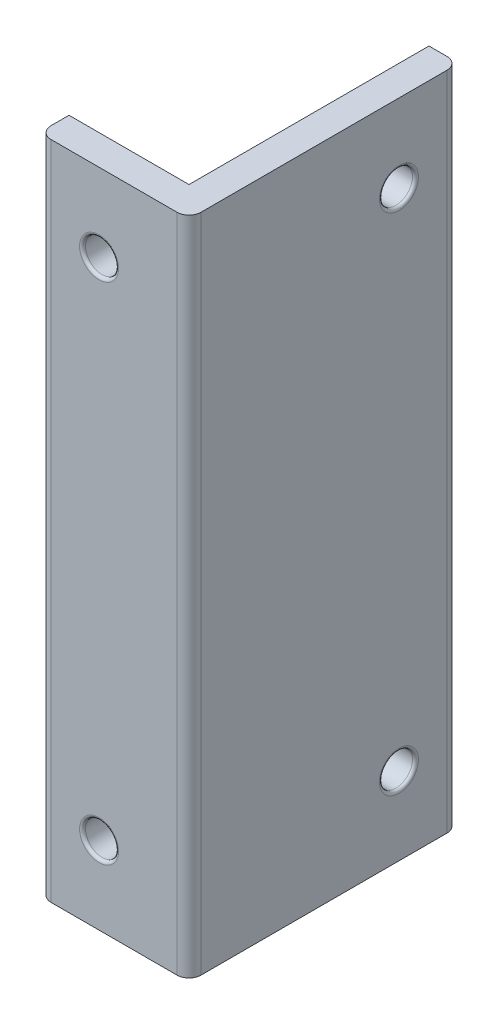
ISO-10303-21;
HEADER;
FILE_DESCRIPTION(('STEP AP214'),'2;1');
FILE_NAME('part.step','',(''),(''),'','','');
FILE_SCHEMA(('AUTOMOTIVE_DESIGN { 1 0 10303 214 1 1 1 1 }'));
ENDSEC;
DATA;
#1=APPLICATION_CONTEXT('core data for automotive mechanical design processes');
#2=APPLICATION_PROTOCOL_DEFINITION('international standard','automotive_design',2000,#1);
#3=PRODUCT_CONTEXT('',#1,'mechanical');
#4=PRODUCT('Part','Part','',(#3));
#5=PRODUCT_RELATED_PRODUCT_CATEGORY('part','',(#4));
#6=PRODUCT_DEFINITION_FORMATION('','',#4);
#7=PRODUCT_DEFINITION_CONTEXT('part definition',#1,'design');
#8=PRODUCT_DEFINITION('design','',#6,#7);
#9=PRODUCT_DEFINITION_SHAPE('','',#8);
#10=(LENGTH_UNIT() NAMED_UNIT(*) SI_UNIT(.MILLI.,.METRE.));
#11=(NAMED_UNIT(*) PLANE_ANGLE_UNIT() SI_UNIT($,.RADIAN.));
#12=(NAMED_UNIT(*) SI_UNIT($,.STERADIAN.) SOLID_ANGLE_UNIT());
#13=UNCERTAINTY_MEASURE_WITH_UNIT(LENGTH_MEASURE(1.E-05),#10,'distance_accuracy_value','');
#14=(GEOMETRIC_REPRESENTATION_CONTEXT(3) GLOBAL_UNCERTAINTY_ASSIGNED_CONTEXT((#13)) GLOBAL_UNIT_ASSIGNED_CONTEXT((#10,
#11,#12)) REPRESENTATION_CONTEXT('',''));
#15=CARTESIAN_POINT('',(0.,0.,0.));
#16=DIRECTION('',(0.,0.,1.));
#17=DIRECTION('',(1.,0.,0.));
#18=AXIS2_PLACEMENT_3D('',#15,#16,#17);
#19=CARTESIAN_POINT('',(12.5,110.14,-42.5));
#20=DIRECTION('',(0.,0.,1.));
#21=DIRECTION('',(1.,0.,0.));
#22=AXIS2_PLACEMENT_3D('',#19,#20,#21);
#23=PLANE('',#22);
#24=DIRECTION('',(-1.,0.,0.));
#25=VECTOR('',#24,1.);
#26=CARTESIAN_POINT('',(12.5,110.14,-42.5));
#27=LINE('',#26,#25);
#28=CARTESIAN_POINT('',(10.5,110.14,-42.5));
#29=VERTEX_POINT('',#28);
#30=CARTESIAN_POINT('',(7.5,110.14,-42.5));
#31=VERTEX_POINT('',#30);
#32=EDGE_CURVE('E112',#29,#31,#27,.T.);
#33=ORIENTED_EDGE('',*,*,#32,.F.);
#34=DIRECTION('',(0.,-1.,0.));
#35=VECTOR('',#34,1.);
#36=CARTESIAN_POINT('',(10.5,110.14,-42.5));
#37=LINE('',#36,#35);
#38=CARTESIAN_POINT('',(10.5,0.,-42.5));
#39=VERTEX_POINT('',#38);
#40=EDGE_CURVE('E51',#29,#39,#37,.T.);
#41=ORIENTED_EDGE('',*,*,#40,.T.);
#42=DIRECTION('',(-1.,0.,0.));
#43=VECTOR('',#42,1.);
#44=CARTESIAN_POINT('',(12.5,0.,-42.5));
#45=LINE('',#44,#43);
#46=CARTESIAN_POINT('',(7.5,0.,-42.5));
#47=VERTEX_POINT('',#46);
#48=EDGE_CURVE('E127',#39,#47,#45,.T.);
#49=ORIENTED_EDGE('',*,*,#48,.T.);
#50=DIRECTION('',(0.,-1.,0.));
#51=VECTOR('',#50,1.);
#52=CARTESIAN_POINT('',(7.5,110.14,-42.5));
#53=LINE('',#52,#51);
#54=EDGE_CURVE('E125',#31,#47,#53,.T.);
#55=ORIENTED_EDGE('',*,*,#54,.F.);
#56=EDGE_LOOP('',(#33,#41,#49,#55));
#57=FACE_BOUND('',#56,.T.);
#58=ADVANCED_FACE('F43',(#57),#23,.F.);
#59=CARTESIAN_POINT('',(7.5,110.14,-2.50000000000003));
#60=DIRECTION('',(1.,0.,0.));
#61=DIRECTION('',(0.,0.,-1.));
#62=AXIS2_PLACEMENT_3D('',#59,#60,#61);
#63=PLANE('',#62);
#64=CARTESIAN_POINT('',(7.5,97.14,-32.5));
#65=DIRECTION('',(1.,0.,0.));
#66=DIRECTION('',(0.,0.,-1.));
#67=AXIS2_PLACEMENT_3D('',#64,#65,#66);
#68=CIRCLE('',#67,3.25);
#69=CARTESIAN_POINT('',(7.5,97.14,-35.75));
#70=VERTEX_POINT('',#69);
#71=EDGE_CURVE('E164',#70,#70,#68,.T.);
#72=ORIENTED_EDGE('',*,*,#71,.T.);
#73=EDGE_LOOP('',(#72));
#74=FACE_BOUND('',#73,.T.);
#75=CARTESIAN_POINT('',(7.5,13.,-32.5));
#76=DIRECTION('',(1.,0.,0.));
#77=DIRECTION('',(0.,0.,-1.));
#78=AXIS2_PLACEMENT_3D('',#75,#76,#77);
#79=CIRCLE('',#78,3.25);
#80=CARTESIAN_POINT('',(7.5,13.,-35.75));
#81=VERTEX_POINT('',#80);
#82=EDGE_CURVE('E130',#81,#81,#79,.T.);
#83=ORIENTED_EDGE('',*,*,#82,.T.);
#84=EDGE_LOOP('',(#83));
#85=FACE_BOUND('',#84,.T.);
#86=DIRECTION('',(0.,0.,1.));
#87=VECTOR('',#86,1.);
#88=CARTESIAN_POINT('',(7.5,0.,-2.50000000000003));
#89=LINE('',#88,#87);
#90=CARTESIAN_POINT('',(7.5,0.,-2.50000000000003));
#91=VERTEX_POINT('',#90);
#92=EDGE_CURVE('E147',#47,#91,#89,.T.);
#93=ORIENTED_EDGE('',*,*,#92,.T.);
#94=DIRECTION('',(0.,-1.,0.));
#95=VECTOR('',#94,1.);
#96=CARTESIAN_POINT('',(7.5,110.14,-2.50000000000003));
#97=LINE('',#96,#95);
#98=CARTESIAN_POINT('',(7.5,110.14,-2.50000000000003));
#99=VERTEX_POINT('',#98);
#100=EDGE_CURVE('E131',#99,#91,#97,.T.);
#101=ORIENTED_EDGE('',*,*,#100,.F.);
#102=DIRECTION('',(0.,0.,1.));
#103=VECTOR('',#102,1.);
#104=CARTESIAN_POINT('',(7.5,110.14,-2.50000000000003));
#105=LINE('',#104,#103);
#106=EDGE_CURVE('E117',#31,#99,#105,.T.);
#107=ORIENTED_EDGE('',*,*,#106,.F.);
#108=ORIENTED_EDGE('',*,*,#54,.T.);
#109=EDGE_LOOP('',(#93,#101,#107,#108));
#110=FACE_BOUND('',#109,.T.);
#111=ADVANCED_FACE('F133',(#74,#85,#110),#63,.F.);
#112=CARTESIAN_POINT('',(-12.5,110.14,-2.5));
#113=DIRECTION('',(0.,0.,1.));
#114=DIRECTION('',(1.,0.,0.));
#115=AXIS2_PLACEMENT_3D('',#112,#113,#114);
#116=PLANE('',#115);
#117=CARTESIAN_POINT('',(-2.49999999999999,13.,-2.50000000000001));
#118=DIRECTION('',(0.,0.,1.));
#119=DIRECTION('',(1.,0.,0.));
#120=AXIS2_PLACEMENT_3D('',#117,#118,#119);
#121=CIRCLE('',#120,3.25);
#122=CARTESIAN_POINT('',(0.750000000000009,13.,-2.50000000000002));
#123=VERTEX_POINT('',#122);
#124=EDGE_CURVE('E188',#123,#123,#121,.T.);
#125=ORIENTED_EDGE('',*,*,#124,.T.);
#126=EDGE_LOOP('',(#125));
#127=FACE_BOUND('',#126,.T.);
#128=CARTESIAN_POINT('',(-2.5,97.14,-2.50000000000001));
#129=DIRECTION('',(0.,0.,1.));
#130=DIRECTION('',(1.,0.,0.));
#131=AXIS2_PLACEMENT_3D('',#128,#129,#130);
#132=CIRCLE('',#131,3.25);
#133=CARTESIAN_POINT('',(0.75,97.14,-2.50000000000002));
#134=VERTEX_POINT('',#133);
#135=EDGE_CURVE('E185',#134,#134,#132,.T.);
#136=ORIENTED_EDGE('',*,*,#135,.T.);
#137=EDGE_LOOP('',(#136));
#138=FACE_BOUND('',#137,.T.);
#139=DIRECTION('',(-1.,0.,0.));
#140=VECTOR('',#139,1.);
#141=CARTESIAN_POINT('',(-12.5,0.,-2.5));
#142=LINE('',#141,#140);
#143=CARTESIAN_POINT('',(-12.5,0.,-2.5));
#144=VERTEX_POINT('',#143);
#145=EDGE_CURVE('E149',#91,#144,#142,.T.);
#146=ORIENTED_EDGE('',*,*,#145,.T.);
#147=DIRECTION('',(0.,-1.,0.));
#148=VECTOR('',#147,1.);
#149=CARTESIAN_POINT('',(-12.5,110.14,-2.5));
#150=LINE('',#149,#148);
#151=CARTESIAN_POINT('',(-12.5,110.14,-2.5));
#152=VERTEX_POINT('',#151);
#153=EDGE_CURVE('E145',#152,#144,#150,.T.);
#154=ORIENTED_EDGE('',*,*,#153,.F.);
#155=DIRECTION('',(-1.,0.,0.));
#156=VECTOR('',#155,1.);
#157=CARTESIAN_POINT('',(-12.5,110.14,-2.5));
#158=LINE('',#157,#156);
#159=EDGE_CURVE('E136',#99,#152,#158,.T.);
#160=ORIENTED_EDGE('',*,*,#159,.F.);
#161=ORIENTED_EDGE('',*,*,#100,.T.);
#162=EDGE_LOOP('',(#146,#154,#160,#161));
#163=FACE_BOUND('',#162,.T.);
#164=ADVANCED_FACE('F236',(#127,#138,#163),#116,.F.);
#165=CARTESIAN_POINT('',(-12.5,110.14,2.5));
#166=DIRECTION('',(1.,0.,0.));
#167=DIRECTION('',(0.,0.,-1.));
#168=AXIS2_PLACEMENT_3D('',#165,#166,#167);
#169=PLANE('',#168);
#170=DIRECTION('',(0.,0.,1.));
#171=VECTOR('',#170,1.);
#172=CARTESIAN_POINT('',(-12.5,0.,2.5));
#173=LINE('',#172,#171);
#174=CARTESIAN_POINT('',(-12.5,0.,0.500000000000002));
#175=VERTEX_POINT('',#174);
#176=EDGE_CURVE('E151',#144,#175,#173,.T.);
#177=ORIENTED_EDGE('',*,*,#176,.T.);
#178=DIRECTION('',(0.,-1.,0.));
#179=VECTOR('',#178,1.);
#180=CARTESIAN_POINT('',(-12.5,110.14,0.500000000000002));
#181=LINE('',#180,#179);
#182=CARTESIAN_POINT('',(-12.5,110.14,0.500000000000002));
#183=VERTEX_POINT('',#182);
#184=EDGE_CURVE('E11',#175,#183,#181,.F.);
#185=ORIENTED_EDGE('',*,*,#184,.T.);
#186=DIRECTION('',(0.,0.,1.));
#187=VECTOR('',#186,1.);
#188=CARTESIAN_POINT('',(-12.5,110.14,2.5));
#189=LINE('',#188,#187);
#190=EDGE_CURVE('E138',#152,#183,#189,.T.);
#191=ORIENTED_EDGE('',*,*,#190,.F.);
#192=ORIENTED_EDGE('',*,*,#153,.T.);
#193=EDGE_LOOP('',(#177,#185,#191,#192));
#194=FACE_BOUND('',#193,.T.);
#195=ADVANCED_FACE('F332',(#194),#169,.F.);
#196=CARTESIAN_POINT('',(-12.5,110.14,2.5));
#197=DIRECTION('',(0.,0.,-1.));
#198=DIRECTION('',(-1.,0.,0.));
#199=AXIS2_PLACEMENT_3D('',#196,#197,#198);
#200=PLANE('',#199);
#201=CARTESIAN_POINT('',(-2.49999999999999,13.,2.5));
#202=DIRECTION('',(0.,0.,-1.));
#203=DIRECTION('',(-1.,0.,0.));
#204=AXIS2_PLACEMENT_3D('',#201,#202,#203);
#205=CIRCLE('',#204,3.25);
#206=CARTESIAN_POINT('',(-5.74999999999999,13.,2.5));
#207=VERTEX_POINT('',#206);
#208=EDGE_CURVE('E200',#207,#207,#205,.T.);
#209=ORIENTED_EDGE('',*,*,#208,.T.);
#210=EDGE_LOOP('',(#209));
#211=FACE_BOUND('',#210,.T.);
#212=CARTESIAN_POINT('',(-2.5,97.14,2.5));
#213=DIRECTION('',(0.,0.,-1.));
#214=DIRECTION('',(-1.,0.,0.));
#215=AXIS2_PLACEMENT_3D('',#212,#213,#214);
#216=CIRCLE('',#215,3.25);
#217=CARTESIAN_POINT('',(-5.75000000000001,97.14,2.5));
#218=VERTEX_POINT('',#217);
#219=EDGE_CURVE('E197',#218,#218,#216,.T.);
#220=ORIENTED_EDGE('',*,*,#219,.T.);
#221=EDGE_LOOP('',(#220));
#222=FACE_BOUND('',#221,.T.);
#223=DIRECTION('',(1.,0.,0.));
#224=VECTOR('',#223,1.);
#225=CARTESIAN_POINT('',(-12.5,0.,2.5));
#226=LINE('',#225,#224);
#227=CARTESIAN_POINT('',(-10.5,0.,2.5));
#228=VERTEX_POINT('',#227);
#229=CARTESIAN_POINT('',(10.5,0.,2.5));
#230=VERTEX_POINT('',#229);
#231=EDGE_CURVE('E153',#228,#230,#226,.T.);
#232=ORIENTED_EDGE('',*,*,#231,.T.);
#233=DIRECTION('',(0.,-1.,0.));
#234=VECTOR('',#233,1.);
#235=CARTESIAN_POINT('',(10.5,110.14,2.5));
#236=LINE('',#235,#234);
#237=CARTESIAN_POINT('',(10.5,110.14,2.5));
#238=VERTEX_POINT('',#237);
#239=EDGE_CURVE('E223',#230,#238,#236,.F.);
#240=ORIENTED_EDGE('',*,*,#239,.T.);
#241=DIRECTION('',(1.,0.,0.));
#242=VECTOR('',#241,1.);
#243=CARTESIAN_POINT('',(-12.5,110.14,2.5));
#244=LINE('',#243,#242);
#245=CARTESIAN_POINT('',(-10.5,110.14,2.5));
#246=VERTEX_POINT('',#245);
#247=EDGE_CURVE('E143',#246,#238,#244,.T.);
#248=ORIENTED_EDGE('',*,*,#247,.F.);
#249=DIRECTION('',(0.,-1.,0.));
#250=VECTOR('',#249,1.);
#251=CARTESIAN_POINT('',(-10.5,110.14,2.5));
#252=LINE('',#251,#250);
#253=EDGE_CURVE('E220',#246,#228,#252,.T.);
#254=ORIENTED_EDGE('',*,*,#253,.T.);
#255=EDGE_LOOP('',(#232,#240,#248,#254));
#256=FACE_BOUND('',#255,.T.);
#257=ADVANCED_FACE('F244',(#211,#222,#256),#200,.F.);
#258=CARTESIAN_POINT('',(12.5,110.14,2.5));
#259=DIRECTION('',(-1.,0.,0.));
#260=DIRECTION('',(0.,0.,1.));
#261=AXIS2_PLACEMENT_3D('',#258,#259,#260);
#262=PLANE('',#261);
#263=CARTESIAN_POINT('',(12.5,97.14,-32.5));
#264=DIRECTION('',(-1.,0.,0.));
#265=DIRECTION('',(0.,0.,1.));
#266=AXIS2_PLACEMENT_3D('',#263,#264,#265);
#267=CIRCLE('',#266,3.25);
#268=CARTESIAN_POINT('',(12.5,97.14,-29.25));
#269=VERTEX_POINT('',#268);
#270=EDGE_CURVE('E176',#269,#269,#267,.T.);
#271=ORIENTED_EDGE('',*,*,#270,.T.);
#272=EDGE_LOOP('',(#271));
#273=FACE_BOUND('',#272,.T.);
#274=CARTESIAN_POINT('',(12.5,13.,-32.5));
#275=DIRECTION('',(-1.,0.,0.));
#276=DIRECTION('',(0.,0.,1.));
#277=AXIS2_PLACEMENT_3D('',#274,#275,#276);
#278=CIRCLE('',#277,3.25);
#279=CARTESIAN_POINT('',(12.5,13.,-29.25));
#280=VERTEX_POINT('',#279);
#281=EDGE_CURVE('E173',#280,#280,#278,.T.);
#282=ORIENTED_EDGE('',*,*,#281,.T.);
#283=EDGE_LOOP('',(#282));
#284=FACE_BOUND('',#283,.T.);
#285=DIRECTION('',(0.,0.,-1.));
#286=VECTOR('',#285,1.);
#287=CARTESIAN_POINT('',(12.5,110.14,-2.50000000000003));
#288=LINE('',#287,#286);
#289=CARTESIAN_POINT('',(12.5,110.14,0.500000000000003));
#290=VERTEX_POINT('',#289);
#291=CARTESIAN_POINT('',(12.5,110.14,-40.5));
#292=VERTEX_POINT('',#291);
#293=EDGE_CURVE('E122',#290,#292,#288,.T.);
#294=ORIENTED_EDGE('',*,*,#293,.F.);
#295=DIRECTION('',(0.,-1.,0.));
#296=VECTOR('',#295,1.);
#297=CARTESIAN_POINT('',(12.5,110.14,0.500000000000003));
#298=LINE('',#297,#296);
#299=CARTESIAN_POINT('',(12.5,0.,0.500000000000003));
#300=VERTEX_POINT('',#299);
#301=EDGE_CURVE('E211',#290,#300,#298,.T.);
#302=ORIENTED_EDGE('',*,*,#301,.T.);
#303=DIRECTION('',(0.,0.,-1.));
#304=VECTOR('',#303,1.);
#305=CARTESIAN_POINT('',(12.5,0.,2.5));
#306=LINE('',#305,#304);
#307=CARTESIAN_POINT('',(12.5,0.,-40.5));
#308=VERTEX_POINT('',#307);
#309=EDGE_CURVE('E156',#300,#308,#306,.T.);
#310=ORIENTED_EDGE('',*,*,#309,.T.);
#311=DIRECTION('',(0.,-1.,0.));
#312=VECTOR('',#311,1.);
#313=CARTESIAN_POINT('',(12.5,110.14,-40.5));
#314=LINE('',#313,#312);
#315=EDGE_CURVE('E209',#308,#292,#314,.F.);
#316=ORIENTED_EDGE('',*,*,#315,.T.);
#317=EDGE_LOOP('',(#294,#302,#310,#316));
#318=FACE_BOUND('',#317,.T.);
#319=ADVANCED_FACE('F252',(#273,#284,#318),#262,.F.);
#320=CARTESIAN_POINT('',(0.,110.14,0.));
#321=DIRECTION('',(0.,1.,0.));
#322=DIRECTION('',(0.,0.,1.));
#323=AXIS2_PLACEMENT_3D('',#320,#321,#322);
#324=PLANE('',#323);
#325=ORIENTED_EDGE('',*,*,#247,.T.);
#326=CARTESIAN_POINT('',(10.5,110.14,0.500000000000003));
#327=DIRECTION('',(0.,1.,0.));
#328=DIRECTION('',(0.,0.,1.));
#329=AXIS2_PLACEMENT_3D('',#326,#327,#328);
#330=CIRCLE('',#329,2.);
#331=EDGE_CURVE('E228',#238,#290,#330,.T.);
#332=ORIENTED_EDGE('',*,*,#331,.T.);
#333=ORIENTED_EDGE('',*,*,#293,.T.);
#334=CARTESIAN_POINT('',(10.5,110.14,-40.5));
#335=DIRECTION('',(0.,1.,0.));
#336=DIRECTION('',(0.,0.,1.));
#337=AXIS2_PLACEMENT_3D('',#334,#335,#336);
#338=CIRCLE('',#337,2.);
#339=EDGE_CURVE('E64',#292,#29,#338,.T.);
#340=ORIENTED_EDGE('',*,*,#339,.T.);
#341=ORIENTED_EDGE('',*,*,#32,.T.);
#342=ORIENTED_EDGE('',*,*,#106,.T.);
#343=ORIENTED_EDGE('',*,*,#159,.T.);
#344=ORIENTED_EDGE('',*,*,#190,.T.);
#345=CARTESIAN_POINT('',(-10.5,110.14,0.500000000000002));
#346=DIRECTION('',(0.,1.,0.));
#347=DIRECTION('',(0.,0.,1.));
#348=AXIS2_PLACEMENT_3D('',#345,#346,#347);
#349=CIRCLE('',#348,2.);
#350=EDGE_CURVE('E225',#183,#246,#349,.T.);
#351=ORIENTED_EDGE('',*,*,#350,.T.);
#352=EDGE_LOOP('',(#325,#332,#333,#340,#341,#342,#343,#344,#351));
#353=FACE_BOUND('',#352,.T.);
#354=ADVANCED_FACE('F115',(#353),#324,.T.);
#355=CARTESIAN_POINT('',(0.,0.,0.));
#356=DIRECTION('',(0.,1.,0.));
#357=DIRECTION('',(0.,0.,1.));
#358=AXIS2_PLACEMENT_3D('',#355,#356,#357);
#359=PLANE('',#358);
#360=ORIENTED_EDGE('',*,*,#309,.F.);
#361=CARTESIAN_POINT('',(10.5,0.,0.500000000000003));
#362=DIRECTION('',(0.,1.,0.));
#363=DIRECTION('',(0.,0.,1.));
#364=AXIS2_PLACEMENT_3D('',#361,#362,#363);
#365=CIRCLE('',#364,2.);
#366=EDGE_CURVE('E218',#300,#230,#365,.F.);
#367=ORIENTED_EDGE('',*,*,#366,.T.);
#368=ORIENTED_EDGE('',*,*,#231,.F.);
#369=CARTESIAN_POINT('',(-10.5,0.,0.500000000000002));
#370=DIRECTION('',(0.,1.,0.));
#371=DIRECTION('',(0.,0.,1.));
#372=AXIS2_PLACEMENT_3D('',#369,#370,#371);
#373=CIRCLE('',#372,2.);
#374=EDGE_CURVE('E214',#228,#175,#373,.F.);
#375=ORIENTED_EDGE('',*,*,#374,.T.);
#376=ORIENTED_EDGE('',*,*,#176,.F.);
#377=ORIENTED_EDGE('',*,*,#145,.F.);
#378=ORIENTED_EDGE('',*,*,#92,.F.);
#379=ORIENTED_EDGE('',*,*,#48,.F.);
#380=CARTESIAN_POINT('',(10.5,0.,-40.5));
#381=DIRECTION('',(0.,1.,0.));
#382=DIRECTION('',(0.,0.,1.));
#383=AXIS2_PLACEMENT_3D('',#380,#381,#382);
#384=CIRCLE('',#383,2.);
#385=EDGE_CURVE('E216',#39,#308,#384,.F.);
#386=ORIENTED_EDGE('',*,*,#385,.T.);
#387=EDGE_LOOP('',(#360,#367,#368,#375,#376,#377,#378,#379,#386));
#388=FACE_BOUND('',#387,.T.);
#389=ADVANCED_FACE('F232',(#388),#359,.F.);
#390=CARTESIAN_POINT('',(-2.5,97.14,-42.5));
#391=DIRECTION('',(0.,0.,1.));
#392=DIRECTION('',(1.,0.,0.));
#393=AXIS2_PLACEMENT_3D('',#390,#391,#392);
#394=CYLINDRICAL_SURFACE('',#393,2.75);
#395=CARTESIAN_POINT('',(-2.5,97.14,-2.00000000000001));
#396=DIRECTION('',(0.,0.,1.));
#397=DIRECTION('',(1.,0.,0.));
#398=AXIS2_PLACEMENT_3D('',#395,#396,#397);
#399=CIRCLE('',#398,2.75);
#400=CARTESIAN_POINT('',(0.250000000000001,97.14,-2.00000000000001));
#401=VERTEX_POINT('',#400);
#402=EDGE_CURVE('E206',#401,#401,#399,.F.);
#403=ORIENTED_EDGE('',*,*,#402,.T.);
#404=EDGE_LOOP('',(#403));
#405=FACE_BOUND('',#404,.T.);
#406=CARTESIAN_POINT('',(-2.5,97.14,2.));
#407=DIRECTION('',(0.,0.,-1.));
#408=DIRECTION('',(-1.,0.,0.));
#409=AXIS2_PLACEMENT_3D('',#406,#407,#408);
#410=CIRCLE('',#409,2.75);
#411=CARTESIAN_POINT('',(-5.25,97.14,2.));
#412=VERTEX_POINT('',#411);
#413=EDGE_CURVE('E203',#412,#412,#410,.F.);
#414=ORIENTED_EDGE('',*,*,#413,.T.);
#415=EDGE_LOOP('',(#414));
#416=FACE_BOUND('',#415,.T.);
#417=ADVANCED_FACE('F309',(#405,#416),#394,.F.);
#418=CARTESIAN_POINT('',(-2.49999999999999,13.,-42.5));
#419=DIRECTION('',(0.,0.,1.));
#420=DIRECTION('',(1.,0.,0.));
#421=AXIS2_PLACEMENT_3D('',#418,#419,#420);
#422=CYLINDRICAL_SURFACE('',#421,2.75);
#423=CARTESIAN_POINT('',(-2.49999999999999,13.,-2.00000000000001));
#424=DIRECTION('',(0.,0.,1.));
#425=DIRECTION('',(1.,0.,0.));
#426=AXIS2_PLACEMENT_3D('',#423,#424,#425);
#427=CIRCLE('',#426,2.75);
#428=CARTESIAN_POINT('',(0.25000000000001,13.,-2.00000000000001));
#429=VERTEX_POINT('',#428);
#430=EDGE_CURVE('E194',#429,#429,#427,.F.);
#431=ORIENTED_EDGE('',*,*,#430,.T.);
#432=EDGE_LOOP('',(#431));
#433=FACE_BOUND('',#432,.T.);
#434=CARTESIAN_POINT('',(-2.49999999999999,13.,2.));
#435=DIRECTION('',(0.,0.,-1.));
#436=DIRECTION('',(-1.,0.,0.));
#437=AXIS2_PLACEMENT_3D('',#434,#435,#436);
#438=CIRCLE('',#437,2.75);
#439=CARTESIAN_POINT('',(-5.24999999999999,13.,2.));
#440=VERTEX_POINT('',#439);
#441=EDGE_CURVE('E191',#440,#440,#438,.F.);
#442=ORIENTED_EDGE('',*,*,#441,.T.);
#443=EDGE_LOOP('',(#442));
#444=FACE_BOUND('',#443,.T.);
#445=ADVANCED_FACE('F311',(#433,#444),#422,.F.);
#446=CARTESIAN_POINT('',(-12.5,13.,-32.5));
#447=DIRECTION('',(1.,0.,0.));
#448=DIRECTION('',(0.,0.,-1.));
#449=AXIS2_PLACEMENT_3D('',#446,#447,#448);
#450=CYLINDRICAL_SURFACE('',#449,2.75);
#451=CARTESIAN_POINT('',(8.,13.,-32.5));
#452=DIRECTION('',(1.,0.,0.));
#453=DIRECTION('',(0.,0.,-1.));
#454=AXIS2_PLACEMENT_3D('',#451,#452,#453);
#455=CIRCLE('',#454,2.75);
#456=CARTESIAN_POINT('',(8.,13.,-35.25));
#457=VERTEX_POINT('',#456);
#458=EDGE_CURVE('E182',#457,#457,#455,.F.);
#459=ORIENTED_EDGE('',*,*,#458,.T.);
#460=EDGE_LOOP('',(#459));
#461=FACE_BOUND('',#460,.T.);
#462=CARTESIAN_POINT('',(12.,13.,-32.5));
#463=DIRECTION('',(-1.,0.,0.));
#464=DIRECTION('',(0.,0.,1.));
#465=AXIS2_PLACEMENT_3D('',#462,#463,#464);
#466=CIRCLE('',#465,2.75);
#467=CARTESIAN_POINT('',(12.,13.,-29.75));
#468=VERTEX_POINT('',#467);
#469=EDGE_CURVE('E179',#468,#468,#466,.F.);
#470=ORIENTED_EDGE('',*,*,#469,.T.);
#471=EDGE_LOOP('',(#470));
#472=FACE_BOUND('',#471,.T.);
#473=ADVANCED_FACE('F318',(#461,#472),#450,.F.);
#474=CARTESIAN_POINT('',(-12.5,97.14,-32.5));
#475=DIRECTION('',(1.,0.,0.));
#476=DIRECTION('',(0.,0.,-1.));
#477=AXIS2_PLACEMENT_3D('',#474,#475,#476);
#478=CYLINDRICAL_SURFACE('',#477,2.75);
#479=CARTESIAN_POINT('',(8.,97.14,-32.5));
#480=DIRECTION('',(1.,0.,0.));
#481=DIRECTION('',(0.,0.,-1.));
#482=AXIS2_PLACEMENT_3D('',#479,#480,#481);
#483=CIRCLE('',#482,2.75);
#484=CARTESIAN_POINT('',(8.,97.14,-35.25));
#485=VERTEX_POINT('',#484);
#486=EDGE_CURVE('E170',#485,#485,#483,.F.);
#487=ORIENTED_EDGE('',*,*,#486,.T.);
#488=EDGE_LOOP('',(#487));
#489=FACE_BOUND('',#488,.T.);
#490=CARTESIAN_POINT('',(12.,97.14,-32.5));
#491=DIRECTION('',(-1.,0.,0.));
#492=DIRECTION('',(0.,0.,1.));
#493=AXIS2_PLACEMENT_3D('',#490,#491,#492);
#494=CIRCLE('',#493,2.75);
#495=CARTESIAN_POINT('',(12.,97.14,-29.75));
#496=VERTEX_POINT('',#495);
#497=EDGE_CURVE('E167',#496,#496,#494,.F.);
#498=ORIENTED_EDGE('',*,*,#497,.T.);
#499=EDGE_LOOP('',(#498));
#500=FACE_BOUND('',#499,.T.);
#501=ADVANCED_FACE('F277',(#489,#500),#478,.F.);
#502=CARTESIAN_POINT('',(8.,97.14,-32.5));
#503=DIRECTION('',(1.,0.,0.));
#504=DIRECTION('',(0.,0.,-1.));
#505=AXIS2_PLACEMENT_3D('',#502,#503,#504);
#506=TOROIDAL_SURFACE('',#505,3.25,0.5);
#507=ORIENTED_EDGE('',*,*,#486,.F.);
#508=EDGE_LOOP('',(#507));
#509=FACE_BOUND('',#508,.T.);
#510=ORIENTED_EDGE('',*,*,#71,.F.);
#511=EDGE_LOOP('',(#510));
#512=FACE_BOUND('',#511,.T.);
#513=ADVANCED_FACE('F273',(#509,#512),#506,.T.);
#514=CARTESIAN_POINT('',(12.,97.14,-32.5));
#515=DIRECTION('',(-1.,0.,0.));
#516=DIRECTION('',(0.,0.,1.));
#517=AXIS2_PLACEMENT_3D('',#514,#515,#516);
#518=TOROIDAL_SURFACE('',#517,3.25,0.5);
#519=ORIENTED_EDGE('',*,*,#270,.F.);
#520=EDGE_LOOP('',(#519));
#521=FACE_BOUND('',#520,.T.);
#522=ORIENTED_EDGE('',*,*,#497,.F.);
#523=EDGE_LOOP('',(#522));
#524=FACE_BOUND('',#523,.T.);
#525=ADVANCED_FACE('F276',(#521,#524),#518,.T.);
#526=CARTESIAN_POINT('',(8.,13.,-32.5));
#527=DIRECTION('',(1.,0.,0.));
#528=DIRECTION('',(0.,0.,-1.));
#529=AXIS2_PLACEMENT_3D('',#526,#527,#528);
#530=TOROIDAL_SURFACE('',#529,3.25,0.5);
#531=ORIENTED_EDGE('',*,*,#458,.F.);
#532=EDGE_LOOP('',(#531));
#533=FACE_BOUND('',#532,.T.);
#534=ORIENTED_EDGE('',*,*,#82,.F.);
#535=EDGE_LOOP('',(#534));
#536=FACE_BOUND('',#535,.T.);
#537=ADVANCED_FACE('F281',(#533,#536),#530,.T.);
#538=CARTESIAN_POINT('',(12.,13.,-32.5));
#539=DIRECTION('',(-1.,0.,0.));
#540=DIRECTION('',(0.,0.,1.));
#541=AXIS2_PLACEMENT_3D('',#538,#539,#540);
#542=TOROIDAL_SURFACE('',#541,3.25,0.5);
#543=ORIENTED_EDGE('',*,*,#281,.F.);
#544=EDGE_LOOP('',(#543));
#545=FACE_BOUND('',#544,.T.);
#546=ORIENTED_EDGE('',*,*,#469,.F.);
#547=EDGE_LOOP('',(#546));
#548=FACE_BOUND('',#547,.T.);
#549=ADVANCED_FACE('F285',(#545,#548),#542,.T.);
#550=CARTESIAN_POINT('',(-2.49999999999999,13.,-2.00000000000001));
#551=DIRECTION('',(0.,0.,1.));
#552=DIRECTION('',(1.,0.,0.));
#553=AXIS2_PLACEMENT_3D('',#550,#551,#552);
#554=TOROIDAL_SURFACE('',#553,3.25,0.5);
#555=ORIENTED_EDGE('',*,*,#430,.F.);
#556=EDGE_LOOP('',(#555));
#557=FACE_BOUND('',#556,.T.);
#558=ORIENTED_EDGE('',*,*,#124,.F.);
#559=EDGE_LOOP('',(#558));
#560=FACE_BOUND('',#559,.T.);
#561=ADVANCED_FACE('F289',(#557,#560),#554,.T.);
#562=CARTESIAN_POINT('',(-2.49999999999999,13.,2.));
#563=DIRECTION('',(0.,0.,-1.));
#564=DIRECTION('',(-1.,0.,0.));
#565=AXIS2_PLACEMENT_3D('',#562,#563,#564);
#566=TOROIDAL_SURFACE('',#565,3.25,0.5);
#567=ORIENTED_EDGE('',*,*,#208,.F.);
#568=EDGE_LOOP('',(#567));
#569=FACE_BOUND('',#568,.T.);
#570=ORIENTED_EDGE('',*,*,#441,.F.);
#571=EDGE_LOOP('',(#570));
#572=FACE_BOUND('',#571,.T.);
#573=ADVANCED_FACE('F293',(#569,#572),#566,.T.);
#574=CARTESIAN_POINT('',(-2.5,97.14,-2.00000000000001));
#575=DIRECTION('',(0.,0.,1.));
#576=DIRECTION('',(1.,0.,0.));
#577=AXIS2_PLACEMENT_3D('',#574,#575,#576);
#578=TOROIDAL_SURFACE('',#577,3.25,0.5);
#579=ORIENTED_EDGE('',*,*,#402,.F.);
#580=EDGE_LOOP('',(#579));
#581=FACE_BOUND('',#580,.T.);
#582=ORIENTED_EDGE('',*,*,#135,.F.);
#583=EDGE_LOOP('',(#582));
#584=FACE_BOUND('',#583,.T.);
#585=ADVANCED_FACE('F297',(#581,#584),#578,.T.);
#586=CARTESIAN_POINT('',(-2.5,97.14,2.));
#587=DIRECTION('',(0.,0.,-1.));
#588=DIRECTION('',(-1.,0.,0.));
#589=AXIS2_PLACEMENT_3D('',#586,#587,#588);
#590=TOROIDAL_SURFACE('',#589,3.25,0.5);
#591=ORIENTED_EDGE('',*,*,#219,.F.);
#592=EDGE_LOOP('',(#591));
#593=FACE_BOUND('',#592,.T.);
#594=ORIENTED_EDGE('',*,*,#413,.F.);
#595=EDGE_LOOP('',(#594));
#596=FACE_BOUND('',#595,.T.);
#597=ADVANCED_FACE('F260',(#593,#596),#590,.T.);
#598=CARTESIAN_POINT('',(10.5,110.14,0.500000000000003));
#599=DIRECTION('',(0.,-1.,0.));
#600=DIRECTION('',(0.,0.,-1.));
#601=AXIS2_PLACEMENT_3D('',#598,#599,#600);
#602=CYLINDRICAL_SURFACE('',#601,2.);
#603=ORIENTED_EDGE('',*,*,#331,.F.);
#604=ORIENTED_EDGE('',*,*,#239,.F.);
#605=ORIENTED_EDGE('',*,*,#366,.F.);
#606=ORIENTED_EDGE('',*,*,#301,.F.);
#607=EDGE_LOOP('',(#603,#604,#605,#606));
#608=FACE_BOUND('',#607,.T.);
#609=ADVANCED_FACE('F249',(#608),#602,.T.);
#610=CARTESIAN_POINT('',(10.5,110.14,-40.5));
#611=DIRECTION('',(0.,-1.,0.));
#612=DIRECTION('',(0.,0.,-1.));
#613=AXIS2_PLACEMENT_3D('',#610,#611,#612);
#614=CYLINDRICAL_SURFACE('',#613,2.);
#615=ORIENTED_EDGE('',*,*,#339,.F.);
#616=ORIENTED_EDGE('',*,*,#315,.F.);
#617=ORIENTED_EDGE('',*,*,#385,.F.);
#618=ORIENTED_EDGE('',*,*,#40,.F.);
#619=EDGE_LOOP('',(#615,#616,#617,#618));
#620=FACE_BOUND('',#619,.T.);
#621=ADVANCED_FACE('F254',(#620),#614,.T.);
#622=CARTESIAN_POINT('',(-10.5,110.14,0.500000000000002));
#623=DIRECTION('',(0.,-1.,0.));
#624=DIRECTION('',(0.,0.,-1.));
#625=AXIS2_PLACEMENT_3D('',#622,#623,#624);
#626=CYLINDRICAL_SURFACE('',#625,2.);
#627=ORIENTED_EDGE('',*,*,#350,.F.);
#628=ORIENTED_EDGE('',*,*,#184,.F.);
#629=ORIENTED_EDGE('',*,*,#374,.F.);
#630=ORIENTED_EDGE('',*,*,#253,.F.);
#631=EDGE_LOOP('',(#627,#628,#629,#630));
#632=FACE_BOUND('',#631,.T.);
#633=ADVANCED_FACE('F45',(#632),#626,.T.);
#634=CLOSED_SHELL('',(#58,#111,#164,#195,#257,#319,#354,#389,#417,#445,#473,#501,#513,#525,#537,
#549,#561,#573,#585,#597,#609,#621,#633));
#635=MANIFOLD_SOLID_BREP('B2',#634);
#636=ADVANCED_BREP_SHAPE_REPRESENTATION('',(#18,#635),#14);
#637=SHAPE_DEFINITION_REPRESENTATION(#9,#636);
ENDSEC;
END-ISO-10303-21;
